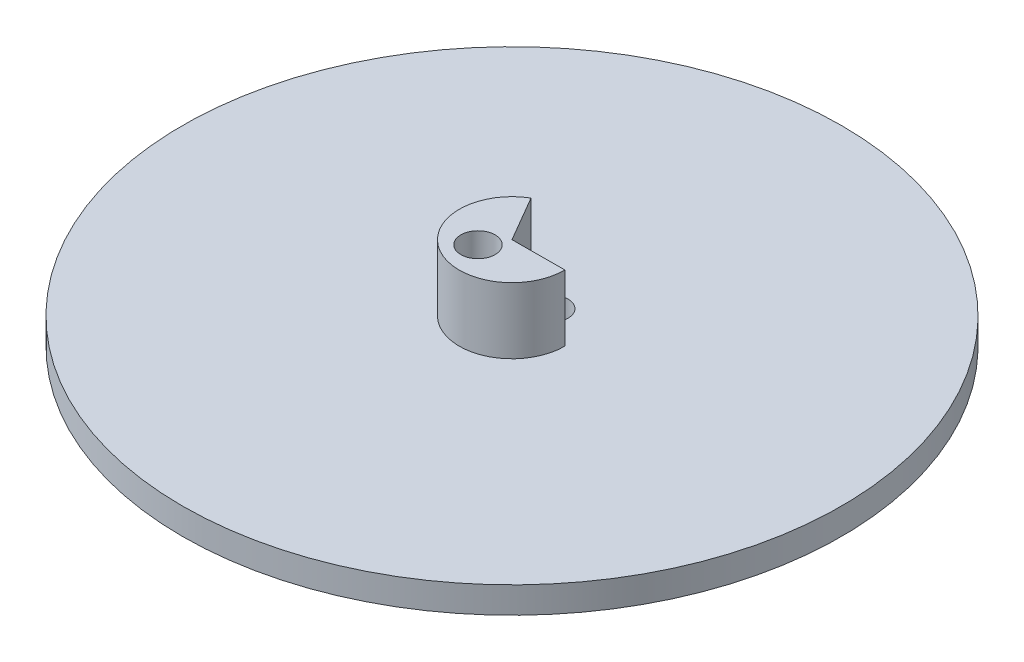
ISO-10303-21;
HEADER;
FILE_DESCRIPTION(('STEP AP214'),'2;1');
FILE_NAME('part.step','',(''),(''),'','','');
FILE_SCHEMA(('AUTOMOTIVE_DESIGN { 1 0 10303 214 1 1 1 1 }'));
ENDSEC;
DATA;
#1=APPLICATION_CONTEXT('core data for automotive mechanical design processes');
#2=APPLICATION_PROTOCOL_DEFINITION('international standard','automotive_design',2000,#1);
#3=PRODUCT_CONTEXT('',#1,'mechanical');
#4=PRODUCT('Part','Part','',(#3));
#5=PRODUCT_RELATED_PRODUCT_CATEGORY('part','',(#4));
#6=PRODUCT_DEFINITION_FORMATION('','',#4);
#7=PRODUCT_DEFINITION_CONTEXT('part definition',#1,'design');
#8=PRODUCT_DEFINITION('design','',#6,#7);
#9=PRODUCT_DEFINITION_SHAPE('','',#8);
#10=(LENGTH_UNIT() NAMED_UNIT(*) SI_UNIT(.MILLI.,.METRE.));
#11=(NAMED_UNIT(*) PLANE_ANGLE_UNIT() SI_UNIT($,.RADIAN.));
#12=(NAMED_UNIT(*) SI_UNIT($,.STERADIAN.) SOLID_ANGLE_UNIT());
#13=UNCERTAINTY_MEASURE_WITH_UNIT(LENGTH_MEASURE(1.E-05),#10,'distance_accuracy_value','');
#14=(GEOMETRIC_REPRESENTATION_CONTEXT(3) GLOBAL_UNCERTAINTY_ASSIGNED_CONTEXT((#13)) GLOBAL_UNIT_ASSIGNED_CONTEXT((#10,
#11,#12)) REPRESENTATION_CONTEXT('',''));
#15=CARTESIAN_POINT('',(0.,0.,0.));
#16=DIRECTION('',(0.,0.,1.));
#17=DIRECTION('',(1.,0.,0.));
#18=AXIS2_PLACEMENT_3D('',#15,#16,#17);
#19=CARTESIAN_POINT('',(0.,5.08,0.));
#20=DIRECTION('',(0.,-1.,0.));
#21=DIRECTION('',(0.,0.,-1.));
#22=AXIS2_PLACEMENT_3D('',#19,#20,#21);
#23=CYLINDRICAL_SURFACE('',#22,63.5);
#24=CARTESIAN_POINT('',(0.,5.08,0.));
#25=DIRECTION('',(0.,1.,0.));
#26=DIRECTION('',(0.,0.,1.));
#27=AXIS2_PLACEMENT_3D('',#24,#25,#26);
#28=CIRCLE('',#27,63.5);
#29=CARTESIAN_POINT('',(0.,5.08,63.5));
#30=VERTEX_POINT('',#29);
#31=EDGE_CURVE('E11',#30,#30,#28,.T.);
#32=ORIENTED_EDGE('',*,*,#31,.F.);
#33=EDGE_LOOP('',(#32));
#34=FACE_BOUND('',#33,.T.);
#35=CARTESIAN_POINT('',(0.,0.,0.));
#36=DIRECTION('',(0.,1.,0.));
#37=DIRECTION('',(0.,0.,1.));
#38=AXIS2_PLACEMENT_3D('',#35,#36,#37);
#39=CIRCLE('',#38,63.5);
#40=CARTESIAN_POINT('',(0.,0.,63.5));
#41=VERTEX_POINT('',#40);
#42=EDGE_CURVE('E38',#41,#41,#39,.T.);
#43=ORIENTED_EDGE('',*,*,#42,.T.);
#44=EDGE_LOOP('',(#43));
#45=FACE_BOUND('',#44,.T.);
#46=ADVANCED_FACE('F35',(#34,#45),#23,.T.);
#47=CARTESIAN_POINT('',(0.,5.08,0.));
#48=DIRECTION('',(0.,1.,0.));
#49=DIRECTION('',(0.,0.,1.));
#50=AXIS2_PLACEMENT_3D('',#47,#48,#49);
#51=PLANE('',#50);
#52=CARTESIAN_POINT('',(2.6284396511187,5.08,-5.0210538216362));
#53=DIRECTION('',(0.,1.,0.));
#54=DIRECTION('',(0.,0.,1.));
#55=AXIS2_PLACEMENT_3D('',#52,#53,#54);
#56=CIRCLE('',#55,3.175);
#57=CARTESIAN_POINT('',(2.6284396511187,5.08,-1.8460538216362));
#58=VERTEX_POINT('',#57);
#59=EDGE_CURVE('E98',#58,#58,#56,.T.);
#60=ORIENTED_EDGE('',*,*,#59,.F.);
#61=EDGE_LOOP('',(#60));
#62=FACE_BOUND('',#61,.T.);
#63=DIRECTION('',(-0.503280491755269,0.,-0.86412310848546));
#64=VECTOR('',#63,1.);
#65=CARTESIAN_POINT('',(-5.11332979623353,5.08,-8.77949078221228));
#66=LINE('',#65,#64);
#67=CARTESIAN_POINT('',(0.,5.08,0.));
#68=VERTEX_POINT('',#67);
#69=CARTESIAN_POINT('',(-5.11332979623353,5.08,-8.77949078221228));
#70=VERTEX_POINT('',#69);
#71=EDGE_CURVE('E93',#68,#70,#66,.T.);
#72=ORIENTED_EDGE('',*,*,#71,.F.);
#73=DIRECTION('',(-0.999992809823219,0.,0.00379213684645291));
#74=VECTOR('',#73,1.);
#75=CARTESIAN_POINT('',(0.,5.08,0.));
#76=LINE('',#75,#74);
#77=CARTESIAN_POINT('',(10.1599269478039,5.08,-0.0385281103599613));
#78=VERTEX_POINT('',#77);
#79=EDGE_CURVE('E84',#78,#68,#76,.T.);
#80=ORIENTED_EDGE('',*,*,#79,.F.);
#81=CARTESIAN_POINT('',(0.,5.08,0.));
#82=DIRECTION('',(0.,1.,0.));
#83=DIRECTION('',(0.,0.,-1.));
#84=AXIS2_PLACEMENT_3D('',#81,#82,#83);
#85=CIRCLE('',#84,10.16);
#86=EDGE_CURVE('E67',#70,#78,#85,.T.);
#87=ORIENTED_EDGE('',*,*,#86,.F.);
#88=EDGE_LOOP('',(#72,#80,#87));
#89=FACE_BOUND('',#88,.T.);
#90=ORIENTED_EDGE('',*,*,#31,.T.);
#91=EDGE_LOOP('',(#90));
#92=FACE_BOUND('',#91,.T.);
#93=ADVANCED_FACE('F131',(#62,#89,#92),#51,.T.);
#94=CARTESIAN_POINT('',(0.,0.,0.));
#95=DIRECTION('',(0.,1.,0.));
#96=DIRECTION('',(0.,0.,1.));
#97=AXIS2_PLACEMENT_3D('',#94,#95,#96);
#98=PLANE('',#97);
#99=CARTESIAN_POINT('',(-2.43265656871294,0.,4.12234040538628));
#100=DIRECTION('',(0.,1.,0.));
#101=DIRECTION('',(0.,0.,1.));
#102=AXIS2_PLACEMENT_3D('',#99,#100,#101);
#103=CIRCLE('',#102,3.302);
#104=CARTESIAN_POINT('',(-2.43265656871294,0.,7.42434040538628));
#105=VERTEX_POINT('',#104);
#106=EDGE_CURVE('E101',#105,#105,#103,.T.);
#107=ORIENTED_EDGE('',*,*,#106,.T.);
#108=EDGE_LOOP('',(#107));
#109=FACE_BOUND('',#108,.T.);
#110=CARTESIAN_POINT('',(2.6284396511187,0.,-5.0210538216362));
#111=DIRECTION('',(0.,1.,0.));
#112=DIRECTION('',(0.,0.,1.));
#113=AXIS2_PLACEMENT_3D('',#110,#111,#112);
#114=CIRCLE('',#113,3.175);
#115=CARTESIAN_POINT('',(2.6284396511187,0.,-1.8460538216362));
#116=VERTEX_POINT('',#115);
#117=EDGE_CURVE('E96',#116,#116,#114,.T.);
#118=ORIENTED_EDGE('',*,*,#117,.T.);
#119=EDGE_LOOP('',(#118));
#120=FACE_BOUND('',#119,.T.);
#121=ORIENTED_EDGE('',*,*,#42,.F.);
#122=EDGE_LOOP('',(#121));
#123=FACE_BOUND('',#122,.T.);
#124=ADVANCED_FACE('F110',(#109,#120,#123),#98,.F.);
#125=CARTESIAN_POINT('',(0.,17.78,0.));
#126=DIRECTION('',(0.00379213684645291,0.,0.999992809823219));
#127=DIRECTION('',(0.99999280982322,0.,-0.00379213684645291));
#128=AXIS2_PLACEMENT_3D('',#125,#126,#127);
#129=PLANE('',#128);
#130=ORIENTED_EDGE('',*,*,#79,.T.);
#131=DIRECTION('',(0.,-1.,0.));
#132=VECTOR('',#131,1.);
#133=CARTESIAN_POINT('',(0.,17.78,0.));
#134=LINE('',#133,#132);
#135=CARTESIAN_POINT('',(0.,17.78,0.));
#136=VERTEX_POINT('',#135);
#137=EDGE_CURVE('E74',#136,#68,#134,.T.);
#138=ORIENTED_EDGE('',*,*,#137,.F.);
#139=DIRECTION('',(-0.999992809823219,0.,0.00379213684645291));
#140=VECTOR('',#139,1.);
#141=CARTESIAN_POINT('',(0.,17.78,0.));
#142=LINE('',#141,#140);
#143=CARTESIAN_POINT('',(10.1599269478039,17.78,-0.0385281103599613));
#144=VERTEX_POINT('',#143);
#145=EDGE_CURVE('E76',#144,#136,#142,.T.);
#146=ORIENTED_EDGE('',*,*,#145,.F.);
#147=DIRECTION('',(0.,-1.,0.));
#148=VECTOR('',#147,1.);
#149=CARTESIAN_POINT('',(10.1599269478039,17.78,-0.0385281103599613));
#150=LINE('',#149,#148);
#151=EDGE_CURVE('E88',#144,#78,#150,.T.);
#152=ORIENTED_EDGE('',*,*,#151,.T.);
#153=EDGE_LOOP('',(#130,#138,#146,#152));
#154=FACE_BOUND('',#153,.T.);
#155=ADVANCED_FACE('F82',(#154),#129,.F.);
#156=CARTESIAN_POINT('',(-5.11332979623353,17.78,-8.77949078221228));
#157=DIRECTION('',(-0.86412310848546,0.,0.503280491755269));
#158=DIRECTION('',(0.503280491755269,0.,0.86412310848546));
#159=AXIS2_PLACEMENT_3D('',#156,#157,#158);
#160=PLANE('',#159);
#161=ORIENTED_EDGE('',*,*,#71,.T.);
#162=DIRECTION('',(0.,-1.,0.));
#163=VECTOR('',#162,1.);
#164=CARTESIAN_POINT('',(-5.11332979623353,17.78,-8.77949078221228));
#165=LINE('',#164,#163);
#166=CARTESIAN_POINT('',(-5.11332979623353,17.78,-8.77949078221228));
#167=VERTEX_POINT('',#166);
#168=EDGE_CURVE('E49',#167,#70,#165,.T.);
#169=ORIENTED_EDGE('',*,*,#168,.F.);
#170=DIRECTION('',(-0.503280491755269,0.,-0.86412310848546));
#171=VECTOR('',#170,1.);
#172=CARTESIAN_POINT('',(-5.11332979623353,17.78,-8.77949078221228));
#173=LINE('',#172,#171);
#174=EDGE_CURVE('E71',#136,#167,#173,.T.);
#175=ORIENTED_EDGE('',*,*,#174,.F.);
#176=ORIENTED_EDGE('',*,*,#137,.T.);
#177=EDGE_LOOP('',(#161,#169,#175,#176));
#178=FACE_BOUND('',#177,.T.);
#179=ADVANCED_FACE('F72',(#178),#160,.F.);
#180=CARTESIAN_POINT('',(0.,17.78,0.));
#181=DIRECTION('',(0.,-1.,0.));
#182=DIRECTION('',(0.,0.,-1.));
#183=AXIS2_PLACEMENT_3D('',#180,#181,#182);
#184=CYLINDRICAL_SURFACE('',#183,10.16);
#185=ORIENTED_EDGE('',*,*,#86,.T.);
#186=ORIENTED_EDGE('',*,*,#151,.F.);
#187=CARTESIAN_POINT('',(0.,17.78,0.));
#188=DIRECTION('',(0.,1.,0.));
#189=DIRECTION('',(0.,0.,-1.));
#190=AXIS2_PLACEMENT_3D('',#187,#188,#189);
#191=CIRCLE('',#190,10.16);
#192=EDGE_CURVE('E57',#167,#144,#191,.T.);
#193=ORIENTED_EDGE('',*,*,#192,.F.);
#194=ORIENTED_EDGE('',*,*,#168,.T.);
#195=EDGE_LOOP('',(#185,#186,#193,#194));
#196=FACE_BOUND('',#195,.T.);
#197=ADVANCED_FACE('F121',(#196),#184,.T.);
#198=CARTESIAN_POINT('',(0.,17.78,0.));
#199=DIRECTION('',(0.,-1.,0.));
#200=DIRECTION('',(0.,0.,-1.));
#201=AXIS2_PLACEMENT_3D('',#198,#199,#200);
#202=PLANE('',#201);
#203=CARTESIAN_POINT('',(-2.43265656871294,17.78,4.12234040538628));
#204=DIRECTION('',(0.,1.,0.));
#205=DIRECTION('',(0.,0.,1.));
#206=AXIS2_PLACEMENT_3D('',#203,#204,#205);
#207=CIRCLE('',#206,3.302);
#208=CARTESIAN_POINT('',(-2.43265656871294,17.78,7.42434040538628));
#209=VERTEX_POINT('',#208);
#210=EDGE_CURVE('E104',#209,#209,#207,.T.);
#211=ORIENTED_EDGE('',*,*,#210,.F.);
#212=EDGE_LOOP('',(#211));
#213=FACE_BOUND('',#212,.T.);
#214=ORIENTED_EDGE('',*,*,#145,.T.);
#215=ORIENTED_EDGE('',*,*,#174,.T.);
#216=ORIENTED_EDGE('',*,*,#192,.T.);
#217=EDGE_LOOP('',(#214,#215,#216));
#218=FACE_BOUND('',#217,.T.);
#219=ADVANCED_FACE('F79',(#213,#218),#202,.F.);
#220=CARTESIAN_POINT('',(2.6284396511187,0.,-5.0210538216362));
#221=DIRECTION('',(0.,1.,0.));
#222=DIRECTION('',(0.,0.,1.));
#223=AXIS2_PLACEMENT_3D('',#220,#221,#222);
#224=CYLINDRICAL_SURFACE('',#223,3.175);
#225=ORIENTED_EDGE('',*,*,#117,.F.);
#226=EDGE_LOOP('',(#225));
#227=FACE_BOUND('',#226,.T.);
#228=ORIENTED_EDGE('',*,*,#59,.T.);
#229=EDGE_LOOP('',(#228));
#230=FACE_BOUND('',#229,.T.);
#231=ADVANCED_FACE('F116',(#227,#230),#224,.F.);
#232=CARTESIAN_POINT('',(-2.43265656871294,0.,4.12234040538628));
#233=DIRECTION('',(0.,1.,0.));
#234=DIRECTION('',(0.,0.,1.));
#235=AXIS2_PLACEMENT_3D('',#232,#233,#234);
#236=CYLINDRICAL_SURFACE('',#235,3.302);
#237=ORIENTED_EDGE('',*,*,#106,.F.);
#238=EDGE_LOOP('',(#237));
#239=FACE_BOUND('',#238,.T.);
#240=ORIENTED_EDGE('',*,*,#210,.T.);
#241=EDGE_LOOP('',(#240));
#242=FACE_BOUND('',#241,.T.);
#243=ADVANCED_FACE('F113',(#239,#242),#236,.F.);
#244=CLOSED_SHELL('',(#46,#93,#124,#155,#179,#197,#219,#231,#243));
#245=MANIFOLD_SOLID_BREP('B2',#244);
#246=ADVANCED_BREP_SHAPE_REPRESENTATION('',(#18,#245),#14);
#247=SHAPE_DEFINITION_REPRESENTATION(#9,#246);
ENDSEC;
END-ISO-10303-21;
